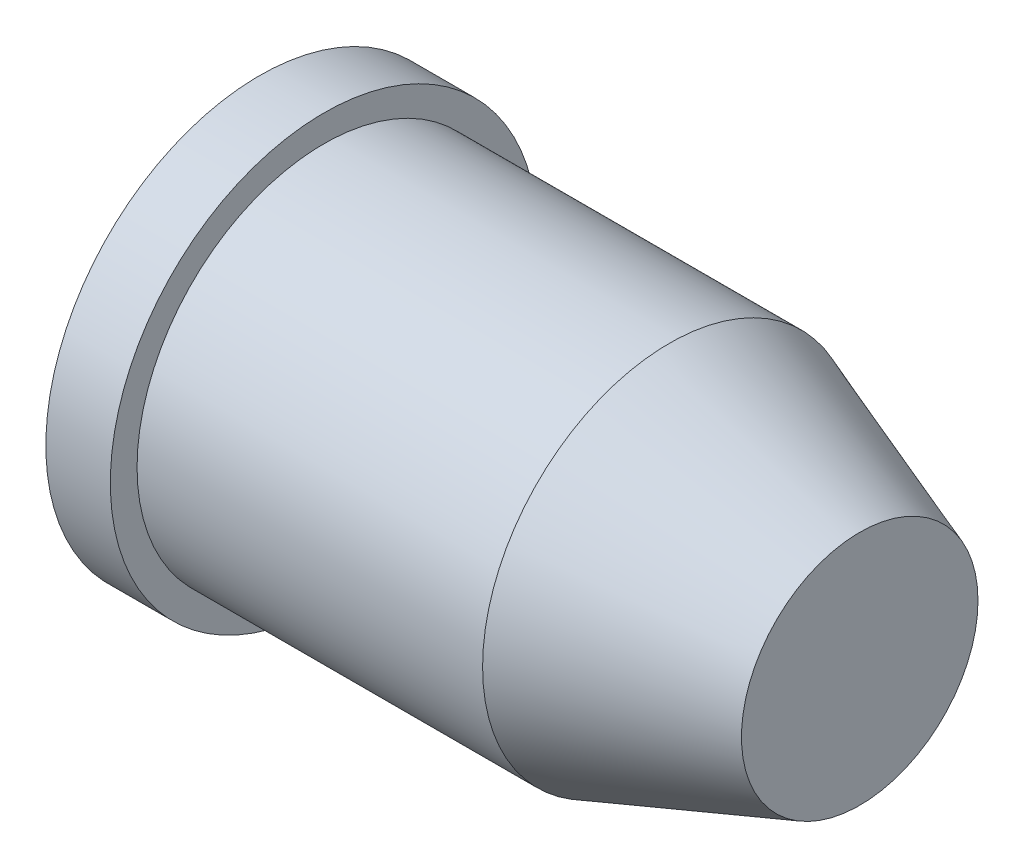
ISO-10303-21;
HEADER;
FILE_DESCRIPTION(('STEP AP214'),'2;1');
FILE_NAME('part.step','',(''),(''),'','','');
FILE_SCHEMA(('AUTOMOTIVE_DESIGN { 1 0 10303 214 1 1 1 1 }'));
ENDSEC;
DATA;
#1=APPLICATION_CONTEXT('core data for automotive mechanical design processes');
#2=APPLICATION_PROTOCOL_DEFINITION('international standard','automotive_design',2000,#1);
#3=PRODUCT_CONTEXT('',#1,'mechanical');
#4=PRODUCT('Part','Part','',(#3));
#5=PRODUCT_RELATED_PRODUCT_CATEGORY('part','',(#4));
#6=PRODUCT_DEFINITION_FORMATION('','',#4);
#7=PRODUCT_DEFINITION_CONTEXT('part definition',#1,'design');
#8=PRODUCT_DEFINITION('design','',#6,#7);
#9=PRODUCT_DEFINITION_SHAPE('','',#8);
#10=(LENGTH_UNIT() NAMED_UNIT(*) SI_UNIT(.MILLI.,.METRE.));
#11=(NAMED_UNIT(*) PLANE_ANGLE_UNIT() SI_UNIT($,.RADIAN.));
#12=(NAMED_UNIT(*) SI_UNIT($,.STERADIAN.) SOLID_ANGLE_UNIT());
#13=UNCERTAINTY_MEASURE_WITH_UNIT(LENGTH_MEASURE(1.E-05),#10,'distance_accuracy_value','');
#14=(GEOMETRIC_REPRESENTATION_CONTEXT(3) GLOBAL_UNCERTAINTY_ASSIGNED_CONTEXT((#13)) GLOBAL_UNIT_ASSIGNED_CONTEXT((#10,
#11,#12)) REPRESENTATION_CONTEXT('',''));
#15=CARTESIAN_POINT('',(0.,0.,0.));
#16=DIRECTION('',(0.,0.,1.));
#17=DIRECTION('',(1.,0.,0.));
#18=AXIS2_PLACEMENT_3D('',#15,#16,#17);
#19=CARTESIAN_POINT('',(113.972001835672,0.,0.));
#20=DIRECTION('',(1.,0.,0.));
#21=DIRECTION('',(0.,0.,-1.));
#22=AXIS2_PLACEMENT_3D('',#19,#20,#21);
#23=CYLINDRICAL_SURFACE('',#22,63.7526012190511);
#24=CARTESIAN_POINT('',(0.,0.,0.));
#25=DIRECTION('',(1.,0.,0.));
#26=DIRECTION('',(0.,0.,-1.));
#27=AXIS2_PLACEMENT_3D('',#24,#25,#26);
#28=CIRCLE('',#27,63.7526012190511);
#29=CARTESIAN_POINT('',(0.,0.,-63.7526012190511));
#30=VERTEX_POINT('',#29);
#31=EDGE_CURVE('E10',#30,#30,#28,.T.);
#32=ORIENTED_EDGE('',*,*,#31,.T.);
#33=EDGE_LOOP('',(#32));
#34=FACE_BOUND('',#33,.T.);
#35=CARTESIAN_POINT('',(19.2489292295721,0.,0.));
#36=DIRECTION('',(1.,0.,0.));
#37=DIRECTION('',(0.,0.,-1.));
#38=AXIS2_PLACEMENT_3D('',#35,#36,#37);
#39=CIRCLE('',#38,63.7526012190511);
#40=CARTESIAN_POINT('',(19.2489292295721,0.,-63.7526012190511));
#41=VERTEX_POINT('',#40);
#42=EDGE_CURVE('E59',#41,#41,#39,.T.);
#43=ORIENTED_EDGE('',*,*,#42,.F.);
#44=EDGE_LOOP('',(#43));
#45=FACE_BOUND('',#44,.T.);
#46=ADVANCED_FACE('F31',(#34,#45),#23,.T.);
#47=CARTESIAN_POINT('',(0.,63.7526012190511,0.));
#48=DIRECTION('',(-1.,0.,0.));
#49=DIRECTION('',(0.,0.,1.));
#50=AXIS2_PLACEMENT_3D('',#47,#48,#49);
#51=PLANE('',#50);
#52=CARTESIAN_POINT('',(0.,0.,0.));
#53=DIRECTION('',(1.,0.,0.));
#54=DIRECTION('',(0.,0.,-1.));
#55=AXIS2_PLACEMENT_3D('',#52,#53,#54);
#56=CIRCLE('',#55,33.8421819198106);
#57=CARTESIAN_POINT('',(0.,0.,-33.8421819198106));
#58=VERTEX_POINT('',#57);
#59=EDGE_CURVE('E37',#58,#58,#56,.T.);
#60=ORIENTED_EDGE('',*,*,#59,.T.);
#61=EDGE_LOOP('',(#60));
#62=FACE_BOUND('',#61,.T.);
#63=ORIENTED_EDGE('',*,*,#31,.F.);
#64=EDGE_LOOP('',(#63));
#65=FACE_BOUND('',#64,.T.);
#66=ADVANCED_FACE('F67',(#62,#65),#51,.T.);
#67=CARTESIAN_POINT('',(113.972001835672,0.,0.));
#68=DIRECTION('',(1.,0.,0.));
#69=DIRECTION('',(0.,0.,-1.));
#70=AXIS2_PLACEMENT_3D('',#67,#68,#69);
#71=CYLINDRICAL_SURFACE('',#70,33.8421819198106);
#72=CARTESIAN_POINT('',(115.531993259508,0.,0.));
#73=DIRECTION('',(1.,0.,0.));
#74=DIRECTION('',(0.,0.,-1.));
#75=AXIS2_PLACEMENT_3D('',#72,#73,#74);
#76=CIRCLE('',#75,33.8421819198106);
#77=CARTESIAN_POINT('',(115.531993259508,0.,-33.8421819198106));
#78=VERTEX_POINT('',#77);
#79=EDGE_CURVE('E41',#78,#78,#76,.T.);
#80=ORIENTED_EDGE('',*,*,#79,.T.);
#81=EDGE_LOOP('',(#80));
#82=FACE_BOUND('',#81,.T.);
#83=ORIENTED_EDGE('',*,*,#59,.F.);
#84=EDGE_LOOP('',(#83));
#85=FACE_BOUND('',#84,.T.);
#86=ADVANCED_FACE('F71',(#82,#85),#71,.F.);
#87=CARTESIAN_POINT('',(115.531993259508,0.,0.));
#88=DIRECTION('',(-1.,0.,0.));
#89=DIRECTION('',(0.,0.,1.));
#90=AXIS2_PLACEMENT_3D('',#87,#88,#89);
#91=CONICAL_SURFACE('',#90,33.8421819198106,0.376105965471217);
#92=CARTESIAN_POINT('',(160.255191640277,0.,0.));
#93=DIRECTION('',(1.,0.,0.));
#94=DIRECTION('',(0.,0.,-1.));
#95=AXIS2_PLACEMENT_3D('',#92,#93,#94);
#96=CIRCLE('',#95,16.1807914764496);
#97=CARTESIAN_POINT('',(160.255191640277,0.,-16.1807914764496));
#98=VERTEX_POINT('',#97);
#99=EDGE_CURVE('E45',#98,#98,#96,.T.);
#100=ORIENTED_EDGE('',*,*,#99,.T.);
#101=EDGE_LOOP('',(#100));
#102=FACE_BOUND('',#101,.T.);
#103=ORIENTED_EDGE('',*,*,#79,.F.);
#104=EDGE_LOOP('',(#103));
#105=FACE_BOUND('',#104,.T.);
#106=ADVANCED_FACE('F75',(#102,#105),#91,.F.);
#107=CARTESIAN_POINT('',(160.255191640277,16.1807914764496,0.));
#108=DIRECTION('',(-1.,0.,0.));
#109=DIRECTION('',(0.,0.,1.));
#110=AXIS2_PLACEMENT_3D('',#107,#108,#109);
#111=PLANE('',#110);
#112=ORIENTED_EDGE('',*,*,#99,.F.);
#113=EDGE_LOOP('',(#112));
#114=FACE_BOUND('',#113,.T.);
#115=ADVANCED_FACE('F82',(#114),#111,.T.);
#116=CARTESIAN_POINT('',(179.143057778085,0.,0.));
#117=DIRECTION('',(1.,0.,0.));
#118=DIRECTION('',(0.,0.,-1.));
#119=AXIS2_PLACEMENT_3D('',#116,#117,#118);
#120=PLANE('',#119);
#121=CARTESIAN_POINT('',(179.143057778085,0.,0.));
#122=DIRECTION('',(1.,0.,0.));
#123=DIRECTION('',(0.,0.,-1.));
#124=AXIS2_PLACEMENT_3D('',#121,#122,#123);
#125=CIRCLE('',#124,35.2960751552049);
#126=CARTESIAN_POINT('',(179.143057778085,0.,-35.2960751552049));
#127=VERTEX_POINT('',#126);
#128=EDGE_CURVE('E50',#127,#127,#125,.T.);
#129=ORIENTED_EDGE('',*,*,#128,.T.);
#130=EDGE_LOOP('',(#129));
#131=FACE_BOUND('',#130,.T.);
#132=ADVANCED_FACE('F86',(#131),#120,.T.);
#133=CARTESIAN_POINT('',(179.143057778085,0.,0.));
#134=DIRECTION('',(-1.,0.,0.));
#135=DIRECTION('',(0.,0.,1.));
#136=AXIS2_PLACEMENT_3D('',#133,#134,#135);
#137=CONICAL_SURFACE('',#136,35.2960751552049,0.346204574455272);
#138=CARTESIAN_POINT('',(122.368660527906,0.,0.));
#139=DIRECTION('',(1.,0.,0.));
#140=DIRECTION('',(0.,0.,-1.));
#141=AXIS2_PLACEMENT_3D('',#138,#139,#140);
#142=CIRCLE('',#141,55.7764894059203);
#143=CARTESIAN_POINT('',(122.368660527906,0.,-55.7764894059203));
#144=VERTEX_POINT('',#143);
#145=EDGE_CURVE('E53',#144,#144,#142,.T.);
#146=ORIENTED_EDGE('',*,*,#145,.T.);
#147=EDGE_LOOP('',(#146));
#148=FACE_BOUND('',#147,.T.);
#149=ORIENTED_EDGE('',*,*,#128,.F.);
#150=EDGE_LOOP('',(#149));
#151=FACE_BOUND('',#150,.T.);
#152=ADVANCED_FACE('F90',(#148,#151),#137,.T.);
#153=CARTESIAN_POINT('',(113.972001835672,0.,0.));
#154=DIRECTION('',(1.,0.,0.));
#155=DIRECTION('',(0.,0.,-1.));
#156=AXIS2_PLACEMENT_3D('',#153,#154,#155);
#157=CYLINDRICAL_SURFACE('',#156,55.7764894059203);
#158=CARTESIAN_POINT('',(19.2489292295721,0.,0.));
#159=DIRECTION('',(1.,0.,0.));
#160=DIRECTION('',(0.,0.,-1.));
#161=AXIS2_PLACEMENT_3D('',#158,#159,#160);
#162=CIRCLE('',#161,55.7764894059203);
#163=CARTESIAN_POINT('',(19.2489292295721,0.,-55.7764894059203));
#164=VERTEX_POINT('',#163);
#165=EDGE_CURVE('E56',#164,#164,#162,.T.);
#166=ORIENTED_EDGE('',*,*,#165,.T.);
#167=EDGE_LOOP('',(#166));
#168=FACE_BOUND('',#167,.T.);
#169=ORIENTED_EDGE('',*,*,#145,.F.);
#170=EDGE_LOOP('',(#169));
#171=FACE_BOUND('',#170,.T.);
#172=ADVANCED_FACE('F94',(#168,#171),#157,.T.);
#173=CARTESIAN_POINT('',(19.2489292295721,55.7764894059203,0.));
#174=DIRECTION('',(1.,0.,0.));
#175=DIRECTION('',(0.,0.,-1.));
#176=AXIS2_PLACEMENT_3D('',#173,#174,#175);
#177=PLANE('',#176);
#178=ORIENTED_EDGE('',*,*,#42,.T.);
#179=EDGE_LOOP('',(#178));
#180=FACE_BOUND('',#179,.T.);
#181=ORIENTED_EDGE('',*,*,#165,.F.);
#182=EDGE_LOOP('',(#181));
#183=FACE_BOUND('',#182,.T.);
#184=ADVANCED_FACE('F63',(#180,#183),#177,.T.);
#185=CLOSED_SHELL('',(#46,#66,#86,#106,#115,#132,#152,#172,#184));
#186=MANIFOLD_SOLID_BREP('B2',#185);
#187=ADVANCED_BREP_SHAPE_REPRESENTATION('',(#18,#186),#14);
#188=SHAPE_DEFINITION_REPRESENTATION(#9,#187);
ENDSEC;
END-ISO-10303-21;
